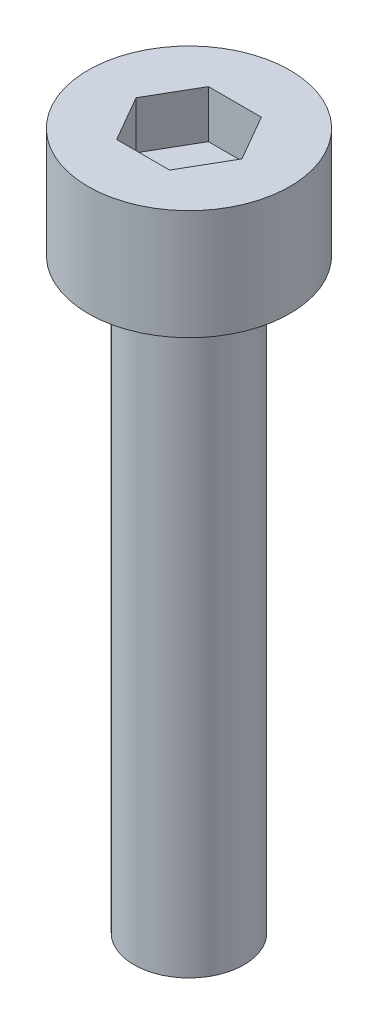
ISO-10303-21;
HEADER;
FILE_DESCRIPTION(('STEP AP214'),'2;1');
FILE_NAME('part.step','',(''),(''),'','','');
FILE_SCHEMA(('AUTOMOTIVE_DESIGN { 1 0 10303 214 1 1 1 1 }'));
ENDSEC;
DATA;
#1=APPLICATION_CONTEXT('core data for automotive mechanical design processes');
#2=APPLICATION_PROTOCOL_DEFINITION('international standard','automotive_design',2000,#1);
#3=PRODUCT_CONTEXT('',#1,'mechanical');
#4=PRODUCT('Part','Part','',(#3));
#5=PRODUCT_RELATED_PRODUCT_CATEGORY('part','',(#4));
#6=PRODUCT_DEFINITION_FORMATION('','',#4);
#7=PRODUCT_DEFINITION_CONTEXT('part definition',#1,'design');
#8=PRODUCT_DEFINITION('design','',#6,#7);
#9=PRODUCT_DEFINITION_SHAPE('','',#8);
#10=(LENGTH_UNIT() NAMED_UNIT(*) SI_UNIT(.MILLI.,.METRE.));
#11=(NAMED_UNIT(*) PLANE_ANGLE_UNIT() SI_UNIT($,.RADIAN.));
#12=(NAMED_UNIT(*) SI_UNIT($,.STERADIAN.) SOLID_ANGLE_UNIT());
#13=UNCERTAINTY_MEASURE_WITH_UNIT(LENGTH_MEASURE(1.E-05),#10,'distance_accuracy_value','');
#14=(GEOMETRIC_REPRESENTATION_CONTEXT(3) GLOBAL_UNCERTAINTY_ASSIGNED_CONTEXT((#13)) GLOBAL_UNIT_ASSIGNED_CONTEXT((#10,
#11,#12)) REPRESENTATION_CONTEXT('',''));
#15=CARTESIAN_POINT('',(0.,0.,0.));
#16=DIRECTION('',(0.,0.,1.));
#17=DIRECTION('',(1.,0.,0.));
#18=AXIS2_PLACEMENT_3D('',#15,#16,#17);
#19=CARTESIAN_POINT('',(0.,3.,0.));
#20=DIRECTION('',(0.,-1.,0.));
#21=DIRECTION('',(0.,0.,-1.));
#22=AXIS2_PLACEMENT_3D('',#19,#20,#21);
#23=CYLINDRICAL_SURFACE('',#22,2.75);
#24=CARTESIAN_POINT('',(0.,3.,0.));
#25=DIRECTION('',(0.,1.,0.));
#26=DIRECTION('',(0.,0.,1.));
#27=AXIS2_PLACEMENT_3D('',#24,#25,#26);
#28=CIRCLE('',#27,2.75);
#29=CARTESIAN_POINT('',(0.,3.,2.75));
#30=VERTEX_POINT('',#29);
#31=EDGE_CURVE('E45',#30,#30,#28,.T.);
#32=ORIENTED_EDGE('',*,*,#31,.F.);
#33=EDGE_LOOP('',(#32));
#34=FACE_BOUND('',#33,.T.);
#35=CARTESIAN_POINT('',(0.,0.,0.));
#36=DIRECTION('',(0.,1.,0.));
#37=DIRECTION('',(0.,0.,1.));
#38=AXIS2_PLACEMENT_3D('',#35,#36,#37);
#39=CIRCLE('',#38,2.75);
#40=CARTESIAN_POINT('',(0.,0.,2.75));
#41=VERTEX_POINT('',#40);
#42=EDGE_CURVE('E40',#41,#41,#39,.T.);
#43=ORIENTED_EDGE('',*,*,#42,.T.);
#44=EDGE_LOOP('',(#43));
#45=FACE_BOUND('',#44,.T.);
#46=ADVANCED_FACE('F37',(#34,#45),#23,.T.);
#47=CARTESIAN_POINT('',(0.,3.,0.));
#48=DIRECTION('',(0.,1.,0.));
#49=DIRECTION('',(0.,0.,1.));
#50=AXIS2_PLACEMENT_3D('',#47,#48,#49);
#51=PLANE('',#50);
#52=DIRECTION('',(0.5,0.,-0.866025403784439));
#53=VECTOR('',#52,1.);
#54=CARTESIAN_POINT('',(0.721687836487032,3.,1.25));
#55=LINE('',#54,#53);
#56=CARTESIAN_POINT('',(0.721687836487032,3.,1.25));
#57=VERTEX_POINT('',#56);
#58=CARTESIAN_POINT('',(1.44337567297406,3.,0.));
#59=VERTEX_POINT('',#58);
#60=EDGE_CURVE('E53',#57,#59,#55,.T.);
#61=ORIENTED_EDGE('',*,*,#60,.F.);
#62=DIRECTION('',(1.,0.,0.));
#63=VECTOR('',#62,1.);
#64=CARTESIAN_POINT('',(-0.721687836487033,3.,1.25));
#65=LINE('',#64,#63);
#66=CARTESIAN_POINT('',(-0.721687836487033,3.,1.25));
#67=VERTEX_POINT('',#66);
#68=EDGE_CURVE('E137',#67,#57,#65,.T.);
#69=ORIENTED_EDGE('',*,*,#68,.F.);
#70=DIRECTION('',(0.5,0.,0.866025403784439));
#71=VECTOR('',#70,1.);
#72=CARTESIAN_POINT('',(-1.44337567297407,3.,0.));
#73=LINE('',#72,#71);
#74=CARTESIAN_POINT('',(-1.44337567297407,3.,0.));
#75=VERTEX_POINT('',#74);
#76=EDGE_CURVE('E135',#75,#67,#73,.T.);
#77=ORIENTED_EDGE('',*,*,#76,.F.);
#78=DIRECTION('',(-0.5,0.,0.866025403784438));
#79=VECTOR('',#78,1.);
#80=CARTESIAN_POINT('',(-0.721687836487033,3.,-1.25));
#81=LINE('',#80,#79);
#82=CARTESIAN_POINT('',(-0.721687836487033,3.,-1.25));
#83=VERTEX_POINT('',#82);
#84=EDGE_CURVE('E101',#83,#75,#81,.T.);
#85=ORIENTED_EDGE('',*,*,#84,.F.);
#86=DIRECTION('',(-1.,0.,0.));
#87=VECTOR('',#86,1.);
#88=CARTESIAN_POINT('',(0.721687836487032,3.,-1.25));
#89=LINE('',#88,#87);
#90=CARTESIAN_POINT('',(0.721687836487032,3.,-1.25));
#91=VERTEX_POINT('',#90);
#92=EDGE_CURVE('E131',#91,#83,#89,.T.);
#93=ORIENTED_EDGE('',*,*,#92,.F.);
#94=DIRECTION('',(-0.5,0.,-0.866025403784439));
#95=VECTOR('',#94,1.);
#96=CARTESIAN_POINT('',(1.44337567297406,3.,0.));
#97=LINE('',#96,#95);
#98=EDGE_CURVE('E127',#59,#91,#97,.T.);
#99=ORIENTED_EDGE('',*,*,#98,.F.);
#100=EDGE_LOOP('',(#61,#69,#77,#85,#93,#99));
#101=FACE_BOUND('',#100,.T.);
#102=ORIENTED_EDGE('',*,*,#31,.T.);
#103=EDGE_LOOP('',(#102));
#104=FACE_BOUND('',#103,.T.);
#105=ADVANCED_FACE('F155',(#101,#104),#51,.T.);
#106=CARTESIAN_POINT('',(0.,0.,0.));
#107=DIRECTION('',(0.,1.,0.));
#108=DIRECTION('',(0.,0.,1.));
#109=AXIS2_PLACEMENT_3D('',#106,#107,#108);
#110=PLANE('',#109);
#111=CARTESIAN_POINT('',(0.,0.,0.));
#112=DIRECTION('',(0.,-1.,0.));
#113=DIRECTION('',(0.,0.,-1.));
#114=AXIS2_PLACEMENT_3D('',#111,#112,#113);
#115=CIRCLE('',#114,1.5);
#116=CARTESIAN_POINT('',(0.,0.,-1.5));
#117=VERTEX_POINT('',#116);
#118=EDGE_CURVE('E11',#117,#117,#115,.T.);
#119=ORIENTED_EDGE('',*,*,#118,.F.);
#120=EDGE_LOOP('',(#119));
#121=FACE_BOUND('',#120,.T.);
#122=ORIENTED_EDGE('',*,*,#42,.F.);
#123=EDGE_LOOP('',(#122));
#124=FACE_BOUND('',#123,.T.);
#125=ADVANCED_FACE('F152',(#121,#124),#110,.F.);
#126=CARTESIAN_POINT('',(0.721687836487032,1.7,1.25));
#127=DIRECTION('',(0.866025403784439,0.,0.5));
#128=DIRECTION('',(0.5,0.,-0.866025403784439));
#129=AXIS2_PLACEMENT_3D('',#126,#127,#128);
#130=PLANE('',#129);
#131=ORIENTED_EDGE('',*,*,#60,.T.);
#132=DIRECTION('',(0.,1.,0.));
#133=VECTOR('',#132,1.);
#134=CARTESIAN_POINT('',(1.44337567297406,1.7,0.));
#135=LINE('',#134,#133);
#136=CARTESIAN_POINT('',(1.44337567297406,1.7,0.));
#137=VERTEX_POINT('',#136);
#138=EDGE_CURVE('E83',#137,#59,#135,.T.);
#139=ORIENTED_EDGE('',*,*,#138,.F.);
#140=DIRECTION('',(0.5,0.,-0.866025403784439));
#141=VECTOR('',#140,1.);
#142=CARTESIAN_POINT('',(0.721687836487032,1.7,1.25));
#143=LINE('',#142,#141);
#144=CARTESIAN_POINT('',(0.721687836487032,1.7,1.25));
#145=VERTEX_POINT('',#144);
#146=EDGE_CURVE('E139',#145,#137,#143,.T.);
#147=ORIENTED_EDGE('',*,*,#146,.F.);
#148=DIRECTION('',(0.,1.,0.));
#149=VECTOR('',#148,1.);
#150=CARTESIAN_POINT('',(0.721687836487032,1.7,1.25));
#151=LINE('',#150,#149);
#152=EDGE_CURVE('E61',#145,#57,#151,.T.);
#153=ORIENTED_EDGE('',*,*,#152,.T.);
#154=EDGE_LOOP('',(#131,#139,#147,#153));
#155=FACE_BOUND('',#154,.T.);
#156=ADVANCED_FACE('F154',(#155),#130,.F.);
#157=CARTESIAN_POINT('',(-0.721687836487033,1.7,1.25));
#158=DIRECTION('',(0.,0.,1.));
#159=DIRECTION('',(1.,0.,0.));
#160=AXIS2_PLACEMENT_3D('',#157,#158,#159);
#161=PLANE('',#160);
#162=ORIENTED_EDGE('',*,*,#68,.T.);
#163=ORIENTED_EDGE('',*,*,#152,.F.);
#164=DIRECTION('',(1.,0.,0.));
#165=VECTOR('',#164,1.);
#166=CARTESIAN_POINT('',(-0.721687836487033,1.7,1.25));
#167=LINE('',#166,#165);
#168=CARTESIAN_POINT('',(-0.721687836487033,1.7,1.25));
#169=VERTEX_POINT('',#168);
#170=EDGE_CURVE('E113',#169,#145,#167,.T.);
#171=ORIENTED_EDGE('',*,*,#170,.F.);
#172=DIRECTION('',(0.,1.,0.));
#173=VECTOR('',#172,1.);
#174=CARTESIAN_POINT('',(-0.721687836487033,1.7,1.25));
#175=LINE('',#174,#173);
#176=EDGE_CURVE('E105',#169,#67,#175,.T.);
#177=ORIENTED_EDGE('',*,*,#176,.T.);
#178=EDGE_LOOP('',(#162,#163,#171,#177));
#179=FACE_BOUND('',#178,.T.);
#180=ADVANCED_FACE('F161',(#179),#161,.F.);
#181=CARTESIAN_POINT('',(-1.44337567297407,1.7,0.));
#182=DIRECTION('',(-0.866025403784439,0.,0.5));
#183=DIRECTION('',(0.5,0.,0.866025403784439));
#184=AXIS2_PLACEMENT_3D('',#181,#182,#183);
#185=PLANE('',#184);
#186=ORIENTED_EDGE('',*,*,#76,.T.);
#187=ORIENTED_EDGE('',*,*,#176,.F.);
#188=DIRECTION('',(0.5,0.,0.866025403784439));
#189=VECTOR('',#188,1.);
#190=CARTESIAN_POINT('',(-1.44337567297407,1.7,0.));
#191=LINE('',#190,#189);
#192=CARTESIAN_POINT('',(-1.44337567297407,1.7,0.));
#193=VERTEX_POINT('',#192);
#194=EDGE_CURVE('E109',#193,#169,#191,.T.);
#195=ORIENTED_EDGE('',*,*,#194,.F.);
#196=DIRECTION('',(0.,1.,0.));
#197=VECTOR('',#196,1.);
#198=CARTESIAN_POINT('',(-1.44337567297407,1.7,0.));
#199=LINE('',#198,#197);
#200=EDGE_CURVE('E94',#193,#75,#199,.T.);
#201=ORIENTED_EDGE('',*,*,#200,.T.);
#202=EDGE_LOOP('',(#186,#187,#195,#201));
#203=FACE_BOUND('',#202,.T.);
#204=ADVANCED_FACE('F110',(#203),#185,.F.);
#205=CARTESIAN_POINT('',(-0.721687836487033,1.7,-1.25));
#206=DIRECTION('',(-0.866025403784439,0.,-0.5));
#207=DIRECTION('',(-0.5,0.,0.866025403784439));
#208=AXIS2_PLACEMENT_3D('',#205,#206,#207);
#209=PLANE('',#208);
#210=ORIENTED_EDGE('',*,*,#84,.T.);
#211=ORIENTED_EDGE('',*,*,#200,.F.);
#212=DIRECTION('',(-0.5,0.,0.866025403784438));
#213=VECTOR('',#212,1.);
#214=CARTESIAN_POINT('',(-0.721687836487033,1.7,-1.25));
#215=LINE('',#214,#213);
#216=CARTESIAN_POINT('',(-0.721687836487033,1.7,-1.25));
#217=VERTEX_POINT('',#216);
#218=EDGE_CURVE('E98',#217,#193,#215,.T.);
#219=ORIENTED_EDGE('',*,*,#218,.F.);
#220=DIRECTION('',(0.,1.,0.));
#221=VECTOR('',#220,1.);
#222=CARTESIAN_POINT('',(-0.721687836487033,1.7,-1.25));
#223=LINE('',#222,#221);
#224=EDGE_CURVE('E106',#217,#83,#223,.T.);
#225=ORIENTED_EDGE('',*,*,#224,.T.);
#226=EDGE_LOOP('',(#210,#211,#219,#225));
#227=FACE_BOUND('',#226,.T.);
#228=ADVANCED_FACE('F96',(#227),#209,.F.);
#229=CARTESIAN_POINT('',(0.721687836487032,1.7,-1.25));
#230=DIRECTION('',(0.,0.,-1.));
#231=DIRECTION('',(-1.,0.,0.));
#232=AXIS2_PLACEMENT_3D('',#229,#230,#231);
#233=PLANE('',#232);
#234=ORIENTED_EDGE('',*,*,#92,.T.);
#235=ORIENTED_EDGE('',*,*,#224,.F.);
#236=DIRECTION('',(-1.,0.,0.));
#237=VECTOR('',#236,1.);
#238=CARTESIAN_POINT('',(0.721687836487032,1.7,-1.25));
#239=LINE('',#238,#237);
#240=CARTESIAN_POINT('',(0.721687836487032,1.7,-1.25));
#241=VERTEX_POINT('',#240);
#242=EDGE_CURVE('E119',#241,#217,#239,.T.);
#243=ORIENTED_EDGE('',*,*,#242,.F.);
#244=DIRECTION('',(0.,1.,0.));
#245=VECTOR('',#244,1.);
#246=CARTESIAN_POINT('',(0.721687836487032,1.7,-1.25));
#247=LINE('',#246,#245);
#248=EDGE_CURVE('E143',#241,#91,#247,.T.);
#249=ORIENTED_EDGE('',*,*,#248,.T.);
#250=EDGE_LOOP('',(#234,#235,#243,#249));
#251=FACE_BOUND('',#250,.T.);
#252=ADVANCED_FACE('F206',(#251),#233,.F.);
#253=CARTESIAN_POINT('',(1.44337567297406,1.7,0.));
#254=DIRECTION('',(0.866025403784439,0.,-0.5));
#255=DIRECTION('',(-0.5,0.,-0.866025403784439));
#256=AXIS2_PLACEMENT_3D('',#253,#254,#255);
#257=PLANE('',#256);
#258=ORIENTED_EDGE('',*,*,#98,.T.);
#259=ORIENTED_EDGE('',*,*,#248,.F.);
#260=DIRECTION('',(-0.5,0.,-0.866025403784439));
#261=VECTOR('',#260,1.);
#262=CARTESIAN_POINT('',(1.44337567297406,1.7,0.));
#263=LINE('',#262,#261);
#264=EDGE_CURVE('E121',#137,#241,#263,.T.);
#265=ORIENTED_EDGE('',*,*,#264,.F.);
#266=ORIENTED_EDGE('',*,*,#138,.T.);
#267=EDGE_LOOP('',(#258,#259,#265,#266));
#268=FACE_BOUND('',#267,.T.);
#269=ADVANCED_FACE('F215',(#268),#257,.F.);
#270=CARTESIAN_POINT('',(0.,1.7,0.));
#271=DIRECTION('',(0.,1.,0.));
#272=DIRECTION('',(0.,0.,1.));
#273=AXIS2_PLACEMENT_3D('',#270,#271,#272);
#274=PLANE('',#273);
#275=ORIENTED_EDGE('',*,*,#146,.T.);
#276=ORIENTED_EDGE('',*,*,#264,.T.);
#277=ORIENTED_EDGE('',*,*,#242,.T.);
#278=ORIENTED_EDGE('',*,*,#218,.T.);
#279=ORIENTED_EDGE('',*,*,#194,.T.);
#280=ORIENTED_EDGE('',*,*,#170,.T.);
#281=EDGE_LOOP('',(#275,#276,#277,#278,#279,#280));
#282=FACE_BOUND('',#281,.T.);
#283=ADVANCED_FACE('F116',(#282),#274,.T.);
#284=CARTESIAN_POINT('',(0.,-16.,0.));
#285=DIRECTION('',(0.,1.,0.));
#286=DIRECTION('',(0.,0.,1.));
#287=AXIS2_PLACEMENT_3D('',#284,#285,#286);
#288=CYLINDRICAL_SURFACE('',#287,1.5);
#289=CARTESIAN_POINT('',(0.,-16.,0.));
#290=DIRECTION('',(0.,-1.,0.));
#291=DIRECTION('',(0.,0.,-1.));
#292=AXIS2_PLACEMENT_3D('',#289,#290,#291);
#293=CIRCLE('',#292,1.5);
#294=CARTESIAN_POINT('',(0.,-16.,-1.5));
#295=VERTEX_POINT('',#294);
#296=EDGE_CURVE('E128',#295,#295,#293,.T.);
#297=ORIENTED_EDGE('',*,*,#296,.F.);
#298=EDGE_LOOP('',(#297));
#299=FACE_BOUND('',#298,.T.);
#300=ORIENTED_EDGE('',*,*,#118,.T.);
#301=EDGE_LOOP('',(#300));
#302=FACE_BOUND('',#301,.T.);
#303=ADVANCED_FACE('F233',(#299,#302),#288,.T.);
#304=CARTESIAN_POINT('',(0.,-16.,0.));
#305=DIRECTION('',(0.,-1.,0.));
#306=DIRECTION('',(0.,0.,-1.));
#307=AXIS2_PLACEMENT_3D('',#304,#305,#306);
#308=PLANE('',#307);
#309=ORIENTED_EDGE('',*,*,#296,.T.);
#310=EDGE_LOOP('',(#309));
#311=FACE_BOUND('',#310,.T.);
#312=ADVANCED_FACE('F247',(#311),#308,.T.);
#313=CLOSED_SHELL('',(#46,#105,#125,#156,#180,#204,#228,#252,#269,#283,#303,#312));
#314=MANIFOLD_SOLID_BREP('B2',#313);
#315=ADVANCED_BREP_SHAPE_REPRESENTATION('',(#18,#314),#14);
#316=SHAPE_DEFINITION_REPRESENTATION(#9,#315);
ENDSEC;
END-ISO-10303-21;
